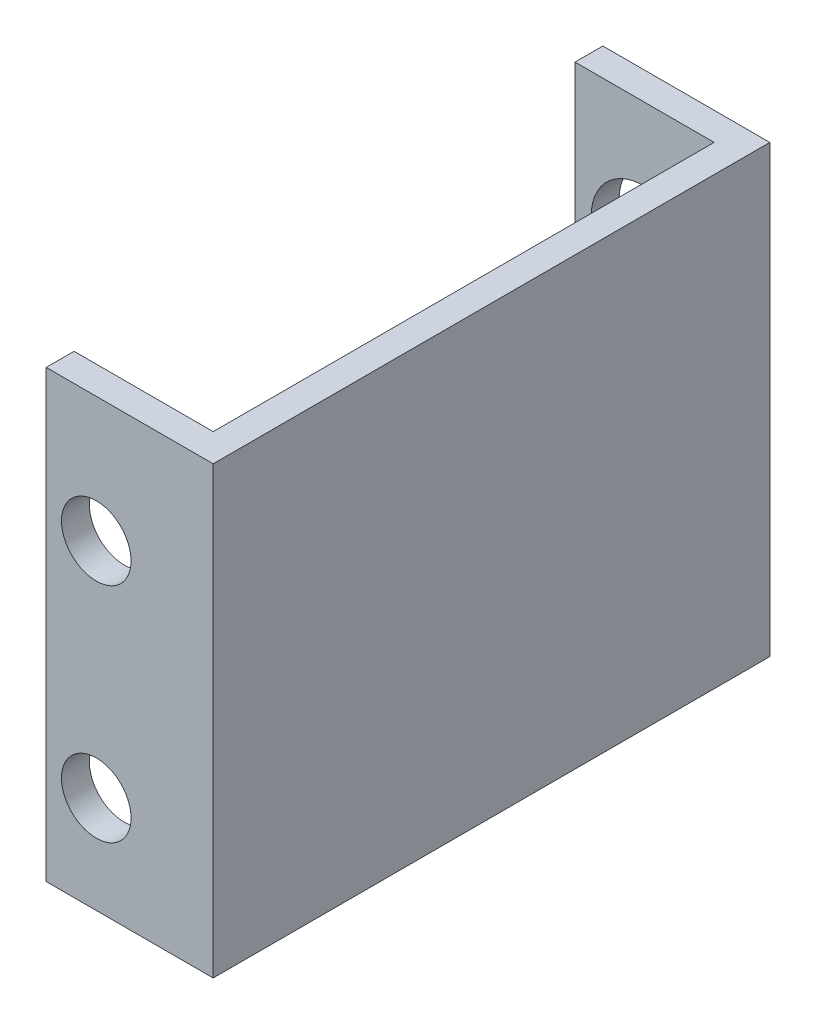
ISO-10303-21;
HEADER;
FILE_DESCRIPTION(('STEP AP214'),'2;1');
FILE_NAME('part.step','',(''),(''),'','','');
FILE_SCHEMA(('AUTOMOTIVE_DESIGN { 1 0 10303 214 1 1 1 1 }'));
ENDSEC;
DATA;
#1=APPLICATION_CONTEXT('core data for automotive mechanical design processes');
#2=APPLICATION_PROTOCOL_DEFINITION('international standard','automotive_design',2000,#1);
#3=PRODUCT_CONTEXT('',#1,'mechanical');
#4=PRODUCT('Part','Part','',(#3));
#5=PRODUCT_RELATED_PRODUCT_CATEGORY('part','',(#4));
#6=PRODUCT_DEFINITION_FORMATION('','',#4);
#7=PRODUCT_DEFINITION_CONTEXT('part definition',#1,'design');
#8=PRODUCT_DEFINITION('design','',#6,#7);
#9=PRODUCT_DEFINITION_SHAPE('','',#8);
#10=(LENGTH_UNIT() NAMED_UNIT(*) SI_UNIT(.MILLI.,.METRE.));
#11=(NAMED_UNIT(*) PLANE_ANGLE_UNIT() SI_UNIT($,.RADIAN.));
#12=(NAMED_UNIT(*) SI_UNIT($,.STERADIAN.) SOLID_ANGLE_UNIT());
#13=UNCERTAINTY_MEASURE_WITH_UNIT(LENGTH_MEASURE(1.E-05),#10,'distance_accuracy_value','');
#14=(GEOMETRIC_REPRESENTATION_CONTEXT(3) GLOBAL_UNCERTAINTY_ASSIGNED_CONTEXT((#13)) GLOBAL_UNIT_ASSIGNED_CONTEXT((#10,
#11,#12)) REPRESENTATION_CONTEXT('',''));
#15=CARTESIAN_POINT('',(0.,0.,0.));
#16=DIRECTION('',(0.,0.,1.));
#17=DIRECTION('',(1.,0.,0.));
#18=AXIS2_PLACEMENT_3D('',#15,#16,#17);
#19=CARTESIAN_POINT('',(-19.05,50.8,-63.5));
#20=DIRECTION('',(0.,0.,1.));
#21=DIRECTION('',(1.,0.,0.));
#22=AXIS2_PLACEMENT_3D('',#19,#20,#21);
#23=PLANE('',#22);
#24=CARTESIAN_POINT('',(-11.2,36.5125,-63.5));
#25=DIRECTION('',(0.,0.,-1.));
#26=DIRECTION('',(-1.,0.,0.));
#27=AXIS2_PLACEMENT_3D('',#24,#25,#26);
#28=CIRCLE('',#27,6.);
#29=CARTESIAN_POINT('',(-17.2,36.5125,-63.5));
#30=VERTEX_POINT('',#29);
#31=EDGE_CURVE('E178',#30,#30,#28,.T.);
#32=ORIENTED_EDGE('',*,*,#31,.F.);
#33=EDGE_LOOP('',(#32));
#34=FACE_BOUND('',#33,.T.);
#35=DIRECTION('',(-1.,0.,0.));
#36=VECTOR('',#35,1.);
#37=CARTESIAN_POINT('',(-19.05,0.,-63.5));
#38=LINE('',#37,#36);
#39=CARTESIAN_POINT('',(0.,0.,-63.5));
#40=VERTEX_POINT('',#39);
#41=CARTESIAN_POINT('',(-19.05,0.,-63.5));
#42=VERTEX_POINT('',#41);
#43=EDGE_CURVE('E130',#40,#42,#38,.T.);
#44=ORIENTED_EDGE('',*,*,#43,.T.);
#45=DIRECTION('',(0.,-1.,0.));
#46=VECTOR('',#45,1.);
#47=CARTESIAN_POINT('',(-19.05,50.8,-63.5));
#48=LINE('',#47,#46);
#49=CARTESIAN_POINT('',(-19.05,50.8,-63.5));
#50=VERTEX_POINT('',#49);
#51=EDGE_CURVE('E11',#50,#42,#48,.T.);
#52=ORIENTED_EDGE('',*,*,#51,.F.);
#53=DIRECTION('',(-1.,0.,0.));
#54=VECTOR('',#53,1.);
#55=CARTESIAN_POINT('',(-19.05,50.8,-63.5));
#56=LINE('',#55,#54);
#57=CARTESIAN_POINT('',(0.,50.8,-63.5));
#58=VERTEX_POINT('',#57);
#59=EDGE_CURVE('E144',#58,#50,#56,.T.);
#60=ORIENTED_EDGE('',*,*,#59,.F.);
#61=DIRECTION('',(0.,-1.,0.));
#62=VECTOR('',#61,1.);
#63=CARTESIAN_POINT('',(0.,50.8,-63.5));
#64=LINE('',#63,#62);
#65=EDGE_CURVE('E126',#58,#40,#64,.T.);
#66=ORIENTED_EDGE('',*,*,#65,.T.);
#67=EDGE_LOOP('',(#44,#52,#60,#66));
#68=FACE_BOUND('',#67,.T.);
#69=ADVANCED_FACE('F33',(#34,#68),#23,.F.);
#70=CARTESIAN_POINT('',(-19.05,50.8,-63.5));
#71=DIRECTION('',(1.,0.,0.));
#72=DIRECTION('',(0.,0.,-1.));
#73=AXIS2_PLACEMENT_3D('',#70,#71,#72);
#74=PLANE('',#73);
#75=DIRECTION('',(0.,0.,1.));
#76=VECTOR('',#75,1.);
#77=CARTESIAN_POINT('',(-19.05,0.,-63.5));
#78=LINE('',#77,#76);
#79=CARTESIAN_POINT('',(-19.05,0.,-60.325));
#80=VERTEX_POINT('',#79);
#81=EDGE_CURVE('E133',#42,#80,#78,.T.);
#82=ORIENTED_EDGE('',*,*,#81,.T.);
#83=DIRECTION('',(0.,-1.,0.));
#84=VECTOR('',#83,1.);
#85=CARTESIAN_POINT('',(-19.05,50.8,-60.325));
#86=LINE('',#85,#84);
#87=CARTESIAN_POINT('',(-19.05,50.8,-60.325));
#88=VERTEX_POINT('',#87);
#89=EDGE_CURVE('E42',#88,#80,#86,.T.);
#90=ORIENTED_EDGE('',*,*,#89,.F.);
#91=DIRECTION('',(0.,0.,1.));
#92=VECTOR('',#91,1.);
#93=CARTESIAN_POINT('',(-19.05,50.8,-63.5));
#94=LINE('',#93,#92);
#95=EDGE_CURVE('E93',#50,#88,#94,.T.);
#96=ORIENTED_EDGE('',*,*,#95,.F.);
#97=ORIENTED_EDGE('',*,*,#51,.T.);
#98=EDGE_LOOP('',(#82,#90,#96,#97));
#99=FACE_BOUND('',#98,.T.);
#100=ADVANCED_FACE('F221',(#99),#74,.F.);
#101=CARTESIAN_POINT('',(-3.17499999999999,50.8,-60.325));
#102=DIRECTION('',(0.,0.,-1.));
#103=DIRECTION('',(-1.,0.,0.));
#104=AXIS2_PLACEMENT_3D('',#101,#102,#103);
#105=PLANE('',#104);
#106=CARTESIAN_POINT('',(-11.2,36.5125,-60.325));
#107=DIRECTION('',(0.,0.,-1.));
#108=DIRECTION('',(-1.,0.,0.));
#109=AXIS2_PLACEMENT_3D('',#106,#107,#108);
#110=CIRCLE('',#109,6.);
#111=CARTESIAN_POINT('',(-17.2,36.5125,-60.325));
#112=VERTEX_POINT('',#111);
#113=EDGE_CURVE('E36',#112,#112,#110,.T.);
#114=ORIENTED_EDGE('',*,*,#113,.T.);
#115=EDGE_LOOP('',(#114));
#116=FACE_BOUND('',#115,.T.);
#117=DIRECTION('',(1.,0.,0.));
#118=VECTOR('',#117,1.);
#119=CARTESIAN_POINT('',(-3.17499999999999,0.,-60.325));
#120=LINE('',#119,#118);
#121=CARTESIAN_POINT('',(-3.17499999999999,0.,-60.325));
#122=VERTEX_POINT('',#121);
#123=EDGE_CURVE('E135',#80,#122,#120,.T.);
#124=ORIENTED_EDGE('',*,*,#123,.T.);
#125=DIRECTION('',(0.,-1.,0.));
#126=VECTOR('',#125,1.);
#127=CARTESIAN_POINT('',(-3.17499999999999,50.8,-60.325));
#128=LINE('',#127,#126);
#129=CARTESIAN_POINT('',(-3.17499999999999,50.8,-60.325));
#130=VERTEX_POINT('',#129);
#131=EDGE_CURVE('E151',#130,#122,#128,.T.);
#132=ORIENTED_EDGE('',*,*,#131,.F.);
#133=DIRECTION('',(1.,0.,0.));
#134=VECTOR('',#133,1.);
#135=CARTESIAN_POINT('',(-3.17499999999999,50.8,-60.325));
#136=LINE('',#135,#134);
#137=EDGE_CURVE('E160',#88,#130,#136,.T.);
#138=ORIENTED_EDGE('',*,*,#137,.F.);
#139=ORIENTED_EDGE('',*,*,#89,.T.);
#140=EDGE_LOOP('',(#124,#132,#138,#139));
#141=FACE_BOUND('',#140,.T.);
#142=ADVANCED_FACE('F158',(#116,#141),#105,.F.);
#143=CARTESIAN_POINT('',(-3.17499999999999,50.8,-3.18));
#144=DIRECTION('',(1.,0.,0.));
#145=DIRECTION('',(0.,0.,-1.));
#146=AXIS2_PLACEMENT_3D('',#143,#144,#145);
#147=PLANE('',#146);
#148=DIRECTION('',(0.,0.,1.));
#149=VECTOR('',#148,1.);
#150=CARTESIAN_POINT('',(-3.17499999999999,0.,-3.18));
#151=LINE('',#150,#149);
#152=CARTESIAN_POINT('',(-3.17499999999999,0.,-3.18));
#153=VERTEX_POINT('',#152);
#154=EDGE_CURVE('E137',#122,#153,#151,.T.);
#155=ORIENTED_EDGE('',*,*,#154,.T.);
#156=DIRECTION('',(0.,-1.,0.));
#157=VECTOR('',#156,1.);
#158=CARTESIAN_POINT('',(-3.17499999999999,50.8,-3.18));
#159=LINE('',#158,#157);
#160=CARTESIAN_POINT('',(-3.17499999999999,50.8,-3.18));
#161=VERTEX_POINT('',#160);
#162=EDGE_CURVE('E148',#161,#153,#159,.T.);
#163=ORIENTED_EDGE('',*,*,#162,.F.);
#164=DIRECTION('',(0.,0.,1.));
#165=VECTOR('',#164,1.);
#166=CARTESIAN_POINT('',(-3.17499999999999,50.8,-3.18));
#167=LINE('',#166,#165);
#168=EDGE_CURVE('E172',#130,#161,#167,.T.);
#169=ORIENTED_EDGE('',*,*,#168,.F.);
#170=ORIENTED_EDGE('',*,*,#131,.T.);
#171=EDGE_LOOP('',(#155,#163,#169,#170));
#172=FACE_BOUND('',#171,.T.);
#173=ADVANCED_FACE('F168',(#172),#147,.F.);
#174=CARTESIAN_POINT('',(-19.05,50.8,-3.18));
#175=DIRECTION('',(0.,0.,1.));
#176=DIRECTION('',(1.,0.,0.));
#177=AXIS2_PLACEMENT_3D('',#174,#175,#176);
#178=PLANE('',#177);
#179=CARTESIAN_POINT('',(-13.335,11.1125,-3.18));
#180=DIRECTION('',(0.,0.,-1.));
#181=DIRECTION('',(-1.,0.,0.));
#182=AXIS2_PLACEMENT_3D('',#179,#180,#181);
#183=CIRCLE('',#182,3.96875);
#184=CARTESIAN_POINT('',(-17.30375,11.1125,-3.18));
#185=VERTEX_POINT('',#184);
#186=EDGE_CURVE('E190',#185,#185,#183,.T.);
#187=ORIENTED_EDGE('',*,*,#186,.F.);
#188=EDGE_LOOP('',(#187));
#189=FACE_BOUND('',#188,.T.);
#190=CARTESIAN_POINT('',(-13.335,36.5125,-3.18));
#191=DIRECTION('',(0.,0.,-1.));
#192=DIRECTION('',(-1.,0.,0.));
#193=AXIS2_PLACEMENT_3D('',#190,#191,#192);
#194=CIRCLE('',#193,3.96875000000001);
#195=CARTESIAN_POINT('',(-17.30375,36.5125,-3.18));
#196=VERTEX_POINT('',#195);
#197=EDGE_CURVE('E184',#196,#196,#194,.T.);
#198=ORIENTED_EDGE('',*,*,#197,.F.);
#199=EDGE_LOOP('',(#198));
#200=FACE_BOUND('',#199,.T.);
#201=DIRECTION('',(-1.,0.,0.));
#202=VECTOR('',#201,1.);
#203=CARTESIAN_POINT('',(-19.05,0.,-3.18));
#204=LINE('',#203,#202);
#205=CARTESIAN_POINT('',(-19.05,0.,-3.18));
#206=VERTEX_POINT('',#205);
#207=EDGE_CURVE('E139',#153,#206,#204,.T.);
#208=ORIENTED_EDGE('',*,*,#207,.T.);
#209=DIRECTION('',(0.,-1.,0.));
#210=VECTOR('',#209,1.);
#211=CARTESIAN_POINT('',(-19.05,50.8,-3.18));
#212=LINE('',#211,#210);
#213=CARTESIAN_POINT('',(-19.05,50.8,-3.18));
#214=VERTEX_POINT('',#213);
#215=EDGE_CURVE('E121',#214,#206,#212,.T.);
#216=ORIENTED_EDGE('',*,*,#215,.F.);
#217=DIRECTION('',(-1.,0.,0.));
#218=VECTOR('',#217,1.);
#219=CARTESIAN_POINT('',(-19.05,50.8,-3.18));
#220=LINE('',#219,#218);
#221=EDGE_CURVE('E112',#161,#214,#220,.T.);
#222=ORIENTED_EDGE('',*,*,#221,.F.);
#223=ORIENTED_EDGE('',*,*,#162,.T.);
#224=EDGE_LOOP('',(#208,#216,#222,#223));
#225=FACE_BOUND('',#224,.T.);
#226=ADVANCED_FACE('F171',(#189,#200,#225),#178,.F.);
#227=CARTESIAN_POINT('',(-19.05,50.8,0.));
#228=DIRECTION('',(1.,0.,0.));
#229=DIRECTION('',(0.,0.,-1.));
#230=AXIS2_PLACEMENT_3D('',#227,#228,#229);
#231=PLANE('',#230);
#232=DIRECTION('',(0.,0.,1.));
#233=VECTOR('',#232,1.);
#234=CARTESIAN_POINT('',(-19.05,0.,0.));
#235=LINE('',#234,#233);
#236=CARTESIAN_POINT('',(-19.05,0.,0.));
#237=VERTEX_POINT('',#236);
#238=EDGE_CURVE('E120',#206,#237,#235,.T.);
#239=ORIENTED_EDGE('',*,*,#238,.T.);
#240=DIRECTION('',(0.,-1.,0.));
#241=VECTOR('',#240,1.);
#242=CARTESIAN_POINT('',(-19.05,50.8,0.));
#243=LINE('',#242,#241);
#244=CARTESIAN_POINT('',(-19.05,50.8,0.));
#245=VERTEX_POINT('',#244);
#246=EDGE_CURVE('E117',#245,#237,#243,.T.);
#247=ORIENTED_EDGE('',*,*,#246,.F.);
#248=DIRECTION('',(0.,0.,1.));
#249=VECTOR('',#248,1.);
#250=CARTESIAN_POINT('',(-19.05,50.8,0.));
#251=LINE('',#250,#249);
#252=EDGE_CURVE('E106',#214,#245,#251,.T.);
#253=ORIENTED_EDGE('',*,*,#252,.F.);
#254=ORIENTED_EDGE('',*,*,#215,.T.);
#255=EDGE_LOOP('',(#239,#247,#253,#254));
#256=FACE_BOUND('',#255,.T.);
#257=ADVANCED_FACE('F118',(#256),#231,.F.);
#258=CARTESIAN_POINT('',(0.,50.8,0.));
#259=DIRECTION('',(0.,0.,-1.));
#260=DIRECTION('',(-1.,0.,0.));
#261=AXIS2_PLACEMENT_3D('',#258,#259,#260);
#262=PLANE('',#261);
#263=CARTESIAN_POINT('',(-13.335,11.1125,0.));
#264=DIRECTION('',(0.,0.,-1.));
#265=DIRECTION('',(-1.,0.,0.));
#266=AXIS2_PLACEMENT_3D('',#263,#264,#265);
#267=CIRCLE('',#266,3.96875);
#268=CARTESIAN_POINT('',(-17.30375,11.1125,0.));
#269=VERTEX_POINT('',#268);
#270=EDGE_CURVE('E187',#269,#269,#267,.F.);
#271=ORIENTED_EDGE('',*,*,#270,.F.);
#272=EDGE_LOOP('',(#271));
#273=FACE_BOUND('',#272,.T.);
#274=CARTESIAN_POINT('',(-13.335,36.5125,0.));
#275=DIRECTION('',(0.,0.,-1.));
#276=DIRECTION('',(-1.,0.,0.));
#277=AXIS2_PLACEMENT_3D('',#274,#275,#276);
#278=CIRCLE('',#277,3.96875000000001);
#279=CARTESIAN_POINT('',(-17.30375,36.5125,0.));
#280=VERTEX_POINT('',#279);
#281=EDGE_CURVE('E181',#280,#280,#278,.F.);
#282=ORIENTED_EDGE('',*,*,#281,.F.);
#283=EDGE_LOOP('',(#282));
#284=FACE_BOUND('',#283,.T.);
#285=DIRECTION('',(1.,0.,0.));
#286=VECTOR('',#285,1.);
#287=CARTESIAN_POINT('',(0.,0.,0.));
#288=LINE('',#287,#286);
#289=CARTESIAN_POINT('',(0.,0.,0.));
#290=VERTEX_POINT('',#289);
#291=EDGE_CURVE('E79',#237,#290,#288,.T.);
#292=ORIENTED_EDGE('',*,*,#291,.T.);
#293=DIRECTION('',(0.,-1.,0.));
#294=VECTOR('',#293,1.);
#295=CARTESIAN_POINT('',(0.,50.8,0.));
#296=LINE('',#295,#294);
#297=CARTESIAN_POINT('',(0.,50.8,0.));
#298=VERTEX_POINT('',#297);
#299=EDGE_CURVE('E122',#298,#290,#296,.T.);
#300=ORIENTED_EDGE('',*,*,#299,.F.);
#301=DIRECTION('',(1.,0.,0.));
#302=VECTOR('',#301,1.);
#303=CARTESIAN_POINT('',(0.,50.8,0.));
#304=LINE('',#303,#302);
#305=EDGE_CURVE('E110',#245,#298,#304,.T.);
#306=ORIENTED_EDGE('',*,*,#305,.F.);
#307=ORIENTED_EDGE('',*,*,#246,.T.);
#308=EDGE_LOOP('',(#292,#300,#306,#307));
#309=FACE_BOUND('',#308,.T.);
#310=ADVANCED_FACE('F124',(#273,#284,#309),#262,.F.);
#311=CARTESIAN_POINT('',(0.,50.8,-63.5));
#312=DIRECTION('',(-1.,0.,0.));
#313=DIRECTION('',(0.,0.,1.));
#314=AXIS2_PLACEMENT_3D('',#311,#312,#313);
#315=PLANE('',#314);
#316=DIRECTION('',(0.,0.,-1.));
#317=VECTOR('',#316,1.);
#318=CARTESIAN_POINT('',(0.,0.,-63.5));
#319=LINE('',#318,#317);
#320=EDGE_CURVE('E85',#290,#40,#319,.T.);
#321=ORIENTED_EDGE('',*,*,#320,.T.);
#322=ORIENTED_EDGE('',*,*,#65,.F.);
#323=DIRECTION('',(0.,0.,-1.));
#324=VECTOR('',#323,1.);
#325=CARTESIAN_POINT('',(0.,50.8,-63.5));
#326=LINE('',#325,#324);
#327=EDGE_CURVE('E50',#298,#58,#326,.T.);
#328=ORIENTED_EDGE('',*,*,#327,.F.);
#329=ORIENTED_EDGE('',*,*,#299,.T.);
#330=EDGE_LOOP('',(#321,#322,#328,#329));
#331=FACE_BOUND('',#330,.T.);
#332=ADVANCED_FACE('F210',(#331),#315,.F.);
#333=CARTESIAN_POINT('',(0.,50.8,0.));
#334=DIRECTION('',(0.,-1.,0.));
#335=DIRECTION('',(0.,0.,-1.));
#336=AXIS2_PLACEMENT_3D('',#333,#334,#335);
#337=PLANE('',#336);
#338=ORIENTED_EDGE('',*,*,#59,.T.);
#339=ORIENTED_EDGE('',*,*,#95,.T.);
#340=ORIENTED_EDGE('',*,*,#137,.T.);
#341=ORIENTED_EDGE('',*,*,#168,.T.);
#342=ORIENTED_EDGE('',*,*,#221,.T.);
#343=ORIENTED_EDGE('',*,*,#252,.T.);
#344=ORIENTED_EDGE('',*,*,#305,.T.);
#345=ORIENTED_EDGE('',*,*,#327,.T.);
#346=EDGE_LOOP('',(#338,#339,#340,#341,#342,#343,#344,#345));
#347=FACE_BOUND('',#346,.T.);
#348=ADVANCED_FACE('F108',(#347),#337,.F.);
#349=CARTESIAN_POINT('',(0.,0.,0.));
#350=DIRECTION('',(0.,-1.,0.));
#351=DIRECTION('',(0.,0.,-1.));
#352=AXIS2_PLACEMENT_3D('',#349,#350,#351);
#353=PLANE('',#352);
#354=ORIENTED_EDGE('',*,*,#43,.F.);
#355=ORIENTED_EDGE('',*,*,#320,.F.);
#356=ORIENTED_EDGE('',*,*,#291,.F.);
#357=ORIENTED_EDGE('',*,*,#238,.F.);
#358=ORIENTED_EDGE('',*,*,#207,.F.);
#359=ORIENTED_EDGE('',*,*,#154,.F.);
#360=ORIENTED_EDGE('',*,*,#123,.F.);
#361=ORIENTED_EDGE('',*,*,#81,.F.);
#362=EDGE_LOOP('',(#354,#355,#356,#357,#358,#359,#360,#361));
#363=FACE_BOUND('',#362,.T.);
#364=ADVANCED_FACE('F164',(#363),#353,.T.);
#365=CARTESIAN_POINT('',(-11.2,36.5125,-59.5));
#366=DIRECTION('',(0.,0.,-1.));
#367=DIRECTION('',(-1.,0.,0.));
#368=AXIS2_PLACEMENT_3D('',#365,#366,#367);
#369=CYLINDRICAL_SURFACE('',#368,6.);
#370=ORIENTED_EDGE('',*,*,#31,.T.);
#371=EDGE_LOOP('',(#370));
#372=FACE_BOUND('',#371,.T.);
#373=ORIENTED_EDGE('',*,*,#113,.F.);
#374=EDGE_LOOP('',(#373));
#375=FACE_BOUND('',#374,.T.);
#376=ADVANCED_FACE('F205',(#372,#375),#369,.F.);
#377=CARTESIAN_POINT('',(-13.335,36.5125,0.0010000000000023));
#378=DIRECTION('',(0.,0.,-1.));
#379=DIRECTION('',(-1.,0.,0.));
#380=AXIS2_PLACEMENT_3D('',#377,#378,#379);
#381=CYLINDRICAL_SURFACE('',#380,3.96875000000001);
#382=ORIENTED_EDGE('',*,*,#197,.T.);
#383=EDGE_LOOP('',(#382));
#384=FACE_BOUND('',#383,.T.);
#385=ORIENTED_EDGE('',*,*,#281,.T.);
#386=EDGE_LOOP('',(#385));
#387=FACE_BOUND('',#386,.T.);
#388=ADVANCED_FACE('F202',(#384,#387),#381,.F.);
#389=CARTESIAN_POINT('',(-13.335,11.1125,0.0010000000000023));
#390=DIRECTION('',(0.,0.,-1.));
#391=DIRECTION('',(-1.,0.,0.));
#392=AXIS2_PLACEMENT_3D('',#389,#390,#391);
#393=CYLINDRICAL_SURFACE('',#392,3.96875);
#394=ORIENTED_EDGE('',*,*,#186,.T.);
#395=EDGE_LOOP('',(#394));
#396=FACE_BOUND('',#395,.T.);
#397=ORIENTED_EDGE('',*,*,#270,.T.);
#398=EDGE_LOOP('',(#397));
#399=FACE_BOUND('',#398,.T.);
#400=ADVANCED_FACE('F194',(#396,#399),#393,.F.);
#401=CLOSED_SHELL('',(#69,#100,#142,#173,#226,#257,#310,#332,#348,#364,#376,#388,#400));
#402=MANIFOLD_SOLID_BREP('B2',#401);
#403=ADVANCED_BREP_SHAPE_REPRESENTATION('',(#18,#402),#14);
#404=SHAPE_DEFINITION_REPRESENTATION(#9,#403);
ENDSEC;
END-ISO-10303-21;
